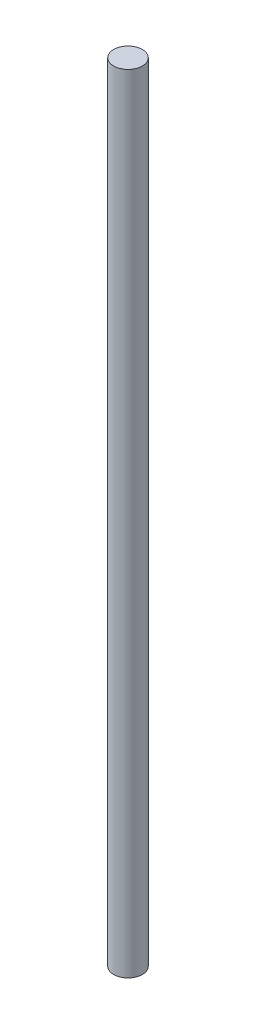
ISO-10303-21;
HEADER;
FILE_DESCRIPTION(('STEP AP214'),'2;1');
FILE_NAME('part.step','',(''),(''),'','','');
FILE_SCHEMA(('AUTOMOTIVE_DESIGN { 1 0 10303 214 1 1 1 1 }'));
ENDSEC;
DATA;
#1=APPLICATION_CONTEXT('core data for automotive mechanical design processes');
#2=APPLICATION_PROTOCOL_DEFINITION('international standard','automotive_design',2000,#1);
#3=PRODUCT_CONTEXT('',#1,'mechanical');
#4=PRODUCT('Part','Part','',(#3));
#5=PRODUCT_RELATED_PRODUCT_CATEGORY('part','',(#4));
#6=PRODUCT_DEFINITION_FORMATION('','',#4);
#7=PRODUCT_DEFINITION_CONTEXT('part definition',#1,'design');
#8=PRODUCT_DEFINITION('design','',#6,#7);
#9=PRODUCT_DEFINITION_SHAPE('','',#8);
#10=(LENGTH_UNIT() NAMED_UNIT(*) SI_UNIT(.MILLI.,.METRE.));
#11=(NAMED_UNIT(*) PLANE_ANGLE_UNIT() SI_UNIT($,.RADIAN.));
#12=(NAMED_UNIT(*) SI_UNIT($,.STERADIAN.) SOLID_ANGLE_UNIT());
#13=UNCERTAINTY_MEASURE_WITH_UNIT(LENGTH_MEASURE(1.E-05),#10,'distance_accuracy_value','');
#14=(GEOMETRIC_REPRESENTATION_CONTEXT(3) GLOBAL_UNCERTAINTY_ASSIGNED_CONTEXT((#13)) GLOBAL_UNIT_ASSIGNED_CONTEXT((#10,
#11,#12)) REPRESENTATION_CONTEXT('',''));
#15=CARTESIAN_POINT('',(0.,0.,0.));
#16=DIRECTION('',(0.,0.,1.));
#17=DIRECTION('',(1.,0.,0.));
#18=AXIS2_PLACEMENT_3D('',#15,#16,#17);
#19=CARTESIAN_POINT('',(0.,152.4,0.));
#20=DIRECTION('',(0.,-1.,0.));
#21=DIRECTION('',(0.,0.,-1.));
#22=AXIS2_PLACEMENT_3D('',#19,#20,#21);
#23=CYLINDRICAL_SURFACE('',#22,5.55625);
#24=CARTESIAN_POINT('',(0.,152.4,0.));
#25=DIRECTION('',(0.,1.,0.));
#26=DIRECTION('',(0.,0.,1.));
#27=AXIS2_PLACEMENT_3D('',#24,#25,#26);
#28=CIRCLE('',#27,5.55625);
#29=CARTESIAN_POINT('',(0.,152.4,5.55625));
#30=VERTEX_POINT('',#29);
#31=EDGE_CURVE('E10',#30,#30,#28,.T.);
#32=ORIENTED_EDGE('',*,*,#31,.F.);
#33=EDGE_LOOP('',(#32));
#34=FACE_BOUND('',#33,.T.);
#35=CARTESIAN_POINT('',(0.,-152.4,0.));
#36=DIRECTION('',(0.,1.,0.));
#37=DIRECTION('',(0.,0.,1.));
#38=AXIS2_PLACEMENT_3D('',#35,#36,#37);
#39=CIRCLE('',#38,5.55625);
#40=CARTESIAN_POINT('',(0.,-152.4,5.55625));
#41=VERTEX_POINT('',#40);
#42=EDGE_CURVE('E33',#41,#41,#39,.T.);
#43=ORIENTED_EDGE('',*,*,#42,.T.);
#44=EDGE_LOOP('',(#43));
#45=FACE_BOUND('',#44,.T.);
#46=ADVANCED_FACE('F30',(#34,#45),#23,.T.);
#47=CARTESIAN_POINT('',(0.,152.4,0.));
#48=DIRECTION('',(0.,1.,0.));
#49=DIRECTION('',(0.,0.,1.));
#50=AXIS2_PLACEMENT_3D('',#47,#48,#49);
#51=PLANE('',#50);
#52=ORIENTED_EDGE('',*,*,#31,.T.);
#53=EDGE_LOOP('',(#52));
#54=FACE_BOUND('',#53,.T.);
#55=ADVANCED_FACE('F45',(#54),#51,.T.);
#56=CARTESIAN_POINT('',(0.,-152.4,0.));
#57=DIRECTION('',(0.,1.,0.));
#58=DIRECTION('',(0.,0.,1.));
#59=AXIS2_PLACEMENT_3D('',#56,#57,#58);
#60=PLANE('',#59);
#61=ORIENTED_EDGE('',*,*,#42,.F.);
#62=EDGE_LOOP('',(#61));
#63=FACE_BOUND('',#62,.T.);
#64=ADVANCED_FACE('F43',(#63),#60,.F.);
#65=CLOSED_SHELL('',(#46,#55,#64));
#66=MANIFOLD_SOLID_BREP('B2',#65);
#67=ADVANCED_BREP_SHAPE_REPRESENTATION('',(#18,#66),#14);
#68=SHAPE_DEFINITION_REPRESENTATION(#9,#67);
ENDSEC;
END-ISO-10303-21;
